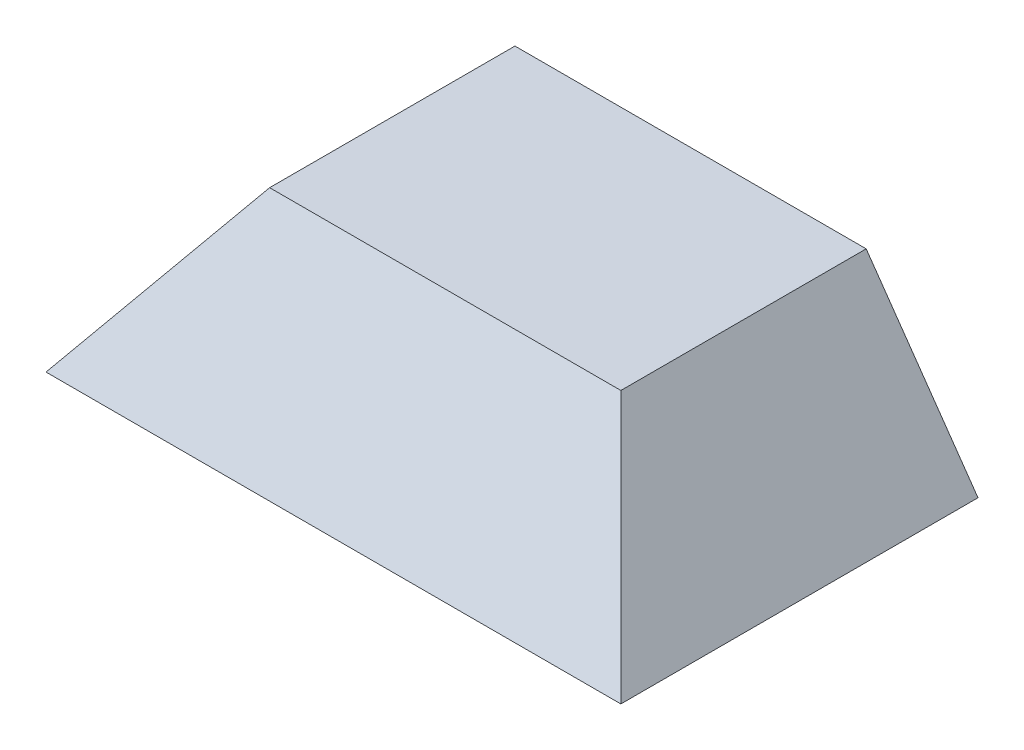
ISO-10303-21;
HEADER;
FILE_DESCRIPTION(('STEP AP214'),'2;1');
FILE_NAME('part.step','',(''),(''),'','','');
FILE_SCHEMA(('AUTOMOTIVE_DESIGN { 1 0 10303 214 1 1 1 1 }'));
ENDSEC;
DATA;
#1=APPLICATION_CONTEXT('core data for automotive mechanical design processes');
#2=APPLICATION_PROTOCOL_DEFINITION('international standard','automotive_design',2000,#1);
#3=PRODUCT_CONTEXT('',#1,'mechanical');
#4=PRODUCT('Part','Part','',(#3));
#5=PRODUCT_RELATED_PRODUCT_CATEGORY('part','',(#4));
#6=PRODUCT_DEFINITION_FORMATION('','',#4);
#7=PRODUCT_DEFINITION_CONTEXT('part definition',#1,'design');
#8=PRODUCT_DEFINITION('design','',#6,#7);
#9=PRODUCT_DEFINITION_SHAPE('','',#8);
#10=(LENGTH_UNIT() NAMED_UNIT(*) SI_UNIT(.MILLI.,.METRE.));
#11=(NAMED_UNIT(*) PLANE_ANGLE_UNIT() SI_UNIT($,.RADIAN.));
#12=(NAMED_UNIT(*) SI_UNIT($,.STERADIAN.) SOLID_ANGLE_UNIT());
#13=UNCERTAINTY_MEASURE_WITH_UNIT(LENGTH_MEASURE(1.E-05),#10,'distance_accuracy_value','');
#14=(GEOMETRIC_REPRESENTATION_CONTEXT(3) GLOBAL_UNCERTAINTY_ASSIGNED_CONTEXT((#13)) GLOBAL_UNIT_ASSIGNED_CONTEXT((#10,
#11,#12)) REPRESENTATION_CONTEXT('',''));
#15=CARTESIAN_POINT('',(0.,0.,0.));
#16=DIRECTION('',(0.,0.,1.));
#17=DIRECTION('',(1.,0.,0.));
#18=AXIS2_PLACEMENT_3D('',#15,#16,#17);
#19=CARTESIAN_POINT('',(-70.,0.,0.));
#20=DIRECTION('',(-1.,0.,0.));
#21=DIRECTION('',(0.,0.,-1.));
#22=AXIS2_PLACEMENT_3D('',#19,#20,#21);
#23=PLANE('',#22);
#24=DIRECTION('',(0.,0.,1.));
#25=VECTOR('',#24,1.);
#26=CARTESIAN_POINT('',(-70.,5.,-8.29628070749418));
#27=LINE('',#26,#25);
#28=CARTESIAN_POINT('',(-70.,5.,-8.29628070749418));
#29=VERTEX_POINT('',#28);
#30=CARTESIAN_POINT('',(-70.,5.,11.7037192925058));
#31=VERTEX_POINT('',#30);
#32=EDGE_CURVE('E242',#29,#31,#27,.T.);
#33=ORIENTED_EDGE('',*,*,#32,.T.);
#34=DIRECTION('',(0.,-1.,0.));
#35=VECTOR('',#34,1.);
#36=CARTESIAN_POINT('',(-70.,0.,11.7037192925058));
#37=LINE('',#36,#35);
#38=CARTESIAN_POINT('',(-70.,0.,11.7037192925058));
#39=VERTEX_POINT('',#38);
#40=EDGE_CURVE('E257',#31,#39,#37,.T.);
#41=ORIENTED_EDGE('',*,*,#40,.T.);
#42=DIRECTION('',(0.,0.,-1.));
#43=VECTOR('',#42,1.);
#44=CARTESIAN_POINT('',(-70.,0.,-8.29628070749418));
#45=LINE('',#44,#43);
#46=CARTESIAN_POINT('',(-70.,0.,-8.29628070749418));
#47=VERTEX_POINT('',#46);
#48=EDGE_CURVE('E261',#39,#47,#45,.T.);
#49=ORIENTED_EDGE('',*,*,#48,.T.);
#50=DIRECTION('',(0.,1.,0.));
#51=VECTOR('',#50,1.);
#52=CARTESIAN_POINT('',(-70.,0.,-8.29628070749418));
#53=LINE('',#52,#51);
#54=EDGE_CURVE('E258',#47,#29,#53,.T.);
#55=ORIENTED_EDGE('',*,*,#54,.T.);
#56=EDGE_LOOP('',(#33,#41,#49,#55));
#57=FACE_BOUND('',#56,.T.);
#58=ADVANCED_FACE('F45',(#57),#23,.F.);
#59=DIRECTION('',(0.,0.,-1.));
#60=VECTOR('',#59,1.);
#61=CARTESIAN_POINT('',(-70.,10.,-8.29628070749418));
#62=LINE('',#61,#60);
#63=CARTESIAN_POINT('',(-70.,10.,11.7037192925058));
#64=VERTEX_POINT('',#63);
#65=CARTESIAN_POINT('',(-70.,10.,-8.29628070749418));
#66=VERTEX_POINT('',#65);
#67=EDGE_CURVE('E586',#64,#66,#62,.T.);
#68=ORIENTED_EDGE('',*,*,#67,.T.);
#69=CARTESIAN_POINT('',(-70.,20.,-8.29628070749418));
#70=VERTEX_POINT('',#69);
#71=EDGE_CURVE('E247',#66,#70,#53,.T.);
#72=ORIENTED_EDGE('',*,*,#71,.T.);
#73=DIRECTION('',(0.,0.,1.));
#74=VECTOR('',#73,1.);
#75=CARTESIAN_POINT('',(-70.,20.,-8.29628070749418));
#76=LINE('',#75,#74);
#77=CARTESIAN_POINT('',(-70.,20.,11.7037192925058));
#78=VERTEX_POINT('',#77);
#79=EDGE_CURVE('E254',#70,#78,#76,.T.);
#80=ORIENTED_EDGE('',*,*,#79,.T.);
#81=EDGE_CURVE('E265',#78,#64,#37,.T.);
#82=ORIENTED_EDGE('',*,*,#81,.T.);
#83=EDGE_LOOP('',(#68,#72,#80,#82));
#84=FACE_BOUND('',#83,.T.);
#85=ADVANCED_FACE('F498',(#84),#23,.F.);
#86=CARTESIAN_POINT('',(-90.002,0.,11.7037192925058));
#87=DIRECTION('',(0.,0.,1.));
#88=DIRECTION('',(1.,0.,0.));
#89=AXIS2_PLACEMENT_3D('',#86,#87,#88);
#90=PLANE('',#89);
#91=ORIENTED_EDGE('',*,*,#40,.F.);
#92=DIRECTION('',(1.,0.,0.));
#93=VECTOR('',#92,1.);
#94=CARTESIAN_POINT('',(-78.,5.,11.7037192925058));
#95=LINE('',#94,#93);
#96=CARTESIAN_POINT('',(-78.,5.,11.7037192925058));
#97=VERTEX_POINT('',#96);
#98=EDGE_CURVE('E249',#97,#31,#95,.T.);
#99=ORIENTED_EDGE('',*,*,#98,.F.);
#100=DIRECTION('',(0.,1.,0.));
#101=VECTOR('',#100,1.);
#102=CARTESIAN_POINT('',(-78.,10.,11.7037192925058));
#103=LINE('',#102,#101);
#104=CARTESIAN_POINT('',(-78.,10.,11.7037192925058));
#105=VERTEX_POINT('',#104);
#106=EDGE_CURVE('E235',#97,#105,#103,.T.);
#107=ORIENTED_EDGE('',*,*,#106,.T.);
#108=DIRECTION('',(1.,0.,0.));
#109=VECTOR('',#108,1.);
#110=CARTESIAN_POINT('',(-78.,10.,11.7037192925058));
#111=LINE('',#110,#109);
#112=EDGE_CURVE('E231',#105,#64,#111,.T.);
#113=ORIENTED_EDGE('',*,*,#112,.T.);
#114=ORIENTED_EDGE('',*,*,#81,.F.);
#115=DIRECTION('',(1.,0.,0.));
#116=VECTOR('',#115,1.);
#117=CARTESIAN_POINT('',(-90.002,20.,11.7037192925058));
#118=LINE('',#117,#116);
#119=CARTESIAN_POINT('',(-71.1127508807601,20.,11.7037192925058));
#120=VERTEX_POINT('',#119);
#121=EDGE_CURVE('E269',#120,#78,#118,.T.);
#122=ORIENTED_EDGE('',*,*,#121,.F.);
#123=DIRECTION('',(-0.573576436351042,-0.819152044288995,0.));
#124=VECTOR('',#123,1.);
#125=CARTESIAN_POINT('',(-86.7240498027007,-2.29524543802496,11.7037192925058));
#126=LINE('',#125,#124);
#127=CARTESIAN_POINT('',(-85.1169016449542,0.,11.7037192925058));
#128=VERTEX_POINT('',#127);
#129=EDGE_CURVE('E276',#120,#128,#126,.T.);
#130=ORIENTED_EDGE('',*,*,#129,.T.);
#131=DIRECTION('',(1.,0.,0.));
#132=VECTOR('',#131,1.);
#133=CARTESIAN_POINT('',(-90.002,0.,11.7037192925058));
#134=LINE('',#133,#132);
#135=EDGE_CURVE('E68',#128,#39,#134,.T.);
#136=ORIENTED_EDGE('',*,*,#135,.T.);
#137=EDGE_LOOP('',(#91,#99,#107,#113,#114,#122,#130,#136));
#138=FACE_BOUND('',#137,.T.);
#139=ADVANCED_FACE('F504',(#138),#90,.T.);
#140=CARTESIAN_POINT('',(-90.002,0.,-8.29628070749418));
#141=DIRECTION('',(0.,0.,-1.));
#142=DIRECTION('',(-1.,0.,0.));
#143=AXIS2_PLACEMENT_3D('',#140,#141,#142);
#144=PLANE('',#143);
#145=DIRECTION('',(0.,-1.,0.));
#146=VECTOR('',#145,1.);
#147=CARTESIAN_POINT('',(-78.,10.,-8.29628070749418));
#148=LINE('',#147,#146);
#149=CARTESIAN_POINT('',(-78.,10.,-8.29628070749418));
#150=VERTEX_POINT('',#149);
#151=CARTESIAN_POINT('',(-78.,5.,-8.29628070749418));
#152=VERTEX_POINT('',#151);
#153=EDGE_CURVE('E236',#150,#152,#148,.T.);
#154=ORIENTED_EDGE('',*,*,#153,.T.);
#155=DIRECTION('',(1.,0.,0.));
#156=VECTOR('',#155,1.);
#157=CARTESIAN_POINT('',(-78.,5.,-8.29628070749418));
#158=LINE('',#157,#156);
#159=EDGE_CURVE('E60',#152,#29,#158,.T.);
#160=ORIENTED_EDGE('',*,*,#159,.T.);
#161=ORIENTED_EDGE('',*,*,#54,.F.);
#162=DIRECTION('',(1.,0.,0.));
#163=VECTOR('',#162,1.);
#164=CARTESIAN_POINT('',(-90.002,0.,-8.29628070749418));
#165=LINE('',#164,#163);
#166=CARTESIAN_POINT('',(-85.1169016449542,0.,-8.29628070749418));
#167=VERTEX_POINT('',#166);
#168=EDGE_CURVE('E272',#167,#47,#165,.T.);
#169=ORIENTED_EDGE('',*,*,#168,.F.);
#170=DIRECTION('',(0.573576436351042,0.819152044288995,0.));
#171=VECTOR('',#170,1.);
#172=CARTESIAN_POINT('',(-86.7240498027007,-2.29524543802496,-8.29628070749418));
#173=LINE('',#172,#171);
#174=CARTESIAN_POINT('',(-71.1127508807601,20.,-8.29628070749418));
#175=VERTEX_POINT('',#174);
#176=EDGE_CURVE('E278',#167,#175,#173,.T.);
#177=ORIENTED_EDGE('',*,*,#176,.T.);
#178=DIRECTION('',(1.,0.,0.));
#179=VECTOR('',#178,1.);
#180=CARTESIAN_POINT('',(-90.002,20.,-8.29628070749418));
#181=LINE('',#180,#179);
#182=EDGE_CURVE('E264',#175,#70,#181,.T.);
#183=ORIENTED_EDGE('',*,*,#182,.T.);
#184=ORIENTED_EDGE('',*,*,#71,.F.);
#185=DIRECTION('',(1.,0.,0.));
#186=VECTOR('',#185,1.);
#187=CARTESIAN_POINT('',(-78.,10.,-8.29628070749418));
#188=LINE('',#187,#186);
#189=EDGE_CURVE('E228',#150,#66,#188,.T.);
#190=ORIENTED_EDGE('',*,*,#189,.F.);
#191=EDGE_LOOP('',(#154,#160,#161,#169,#177,#183,#184,#190));
#192=FACE_BOUND('',#191,.T.);
#193=ADVANCED_FACE('F245',(#192),#144,.T.);
#194=CARTESIAN_POINT('',(70.,0.,0.));
#195=DIRECTION('',(1.,0.,0.));
#196=DIRECTION('',(0.,0.,-1.));
#197=AXIS2_PLACEMENT_3D('',#194,#195,#196);
#198=PLANE('',#197);
#199=DIRECTION('',(0.,1.,0.));
#200=VECTOR('',#199,1.);
#201=CARTESIAN_POINT('',(70.,0.,-8.29628070749418));
#202=LINE('',#201,#200);
#203=CARTESIAN_POINT('',(70.,10.,-8.29628070749418));
#204=VERTEX_POINT('',#203);
#205=CARTESIAN_POINT('',(70.,20.,-8.29628070749418));
#206=VERTEX_POINT('',#205);
#207=EDGE_CURVE('E304',#204,#206,#202,.T.);
#208=ORIENTED_EDGE('',*,*,#207,.F.);
#209=DIRECTION('',(0.,0.,-1.));
#210=VECTOR('',#209,1.);
#211=CARTESIAN_POINT('',(70.,10.,-8.29628070749418));
#212=LINE('',#211,#210);
#213=CARTESIAN_POINT('',(70.,10.,11.7037192925058));
#214=VERTEX_POINT('',#213);
#215=EDGE_CURVE('E291',#214,#204,#212,.T.);
#216=ORIENTED_EDGE('',*,*,#215,.F.);
#217=DIRECTION('',(0.,-1.,0.));
#218=VECTOR('',#217,1.);
#219=CARTESIAN_POINT('',(70.,0.,11.7037192925058));
#220=LINE('',#219,#218);
#221=CARTESIAN_POINT('',(70.,20.,11.7037192925058));
#222=VERTEX_POINT('',#221);
#223=EDGE_CURVE('E322',#222,#214,#220,.T.);
#224=ORIENTED_EDGE('',*,*,#223,.F.);
#225=DIRECTION('',(0.,0.,1.));
#226=VECTOR('',#225,1.);
#227=CARTESIAN_POINT('',(70.,20.,-8.29628070749418));
#228=LINE('',#227,#226);
#229=EDGE_CURVE('E311',#206,#222,#228,.T.);
#230=ORIENTED_EDGE('',*,*,#229,.F.);
#231=EDGE_LOOP('',(#208,#216,#224,#230));
#232=FACE_BOUND('',#231,.T.);
#233=ADVANCED_FACE('F486',(#232),#198,.F.);
#234=CARTESIAN_POINT('',(86.723391822844,-2.29430574540417,-64.666));
#235=DIRECTION('',(-0.819152044288995,-0.573576436351042,0.));
#236=DIRECTION('',(0.573576436351042,-0.819152044288995,0.));
#237=AXIS2_PLACEMENT_3D('',#234,#235,#236);
#238=PLANE('',#237);
#239=DIRECTION('',(0.573576436351042,-0.819152044288995,0.));
#240=VECTOR('',#239,1.);
#241=CARTESIAN_POINT('',(86.723391822844,-2.29430574540417,0.));
#242=LINE('',#241,#240);
#243=CARTESIAN_POINT('',(52.9073548873079,46.,0.));
#244=VERTEX_POINT('',#243);
#245=CARTESIAN_POINT('',(71.1127508807601,20.,0.));
#246=VERTEX_POINT('',#245);
#247=EDGE_CURVE('E379',#244,#246,#242,.T.);
#248=ORIENTED_EDGE('',*,*,#247,.T.);
#249=DIRECTION('',(0.,0.,-1.));
#250=VECTOR('',#249,1.);
#251=CARTESIAN_POINT('',(71.1127508807601,20.,-8.29628070749418));
#252=LINE('',#251,#250);
#253=CARTESIAN_POINT('',(71.1127508807601,20.,11.7037192925058));
#254=VERTEX_POINT('',#253);
#255=EDGE_CURVE('E337',#254,#246,#252,.T.);
#256=ORIENTED_EDGE('',*,*,#255,.F.);
#257=DIRECTION('',(-0.573576436351042,0.819152044288995,0.));
#258=VECTOR('',#257,1.);
#259=CARTESIAN_POINT('',(86.7240498027007,-2.29524543802498,11.7037192925058));
#260=LINE('',#259,#258);
#261=CARTESIAN_POINT('',(85.1169016449542,0.,11.7037192925058));
#262=VERTEX_POINT('',#261);
#263=EDGE_CURVE('E328',#262,#254,#260,.T.);
#264=ORIENTED_EDGE('',*,*,#263,.F.);
#265=DIRECTION('',(0.,0.,-1.));
#266=VECTOR('',#265,1.);
#267=CARTESIAN_POINT('',(85.1169016449542,0.,-64.666));
#268=LINE('',#267,#266);
#269=CARTESIAN_POINT('',(85.1169016449542,0.,59.7819016449542));
#270=VERTEX_POINT('',#269);
#271=EDGE_CURVE('E396',#270,#262,#268,.T.);
#272=ORIENTED_EDGE('',*,*,#271,.F.);
#273=DIRECTION('',(0.49754281216452,-0.710564775461634,0.49754281216452));
#274=VECTOR('',#273,1.);
#275=CARTESIAN_POINT('',(87.5347599576417,-3.45305952984959,62.1997599576417));
#276=LINE('',#275,#274);
#277=CARTESIAN_POINT('',(52.9073548873079,46.,27.5723548873079));
#278=VERTEX_POINT('',#277);
#279=EDGE_CURVE('E385',#278,#270,#276,.T.);
#280=ORIENTED_EDGE('',*,*,#279,.F.);
#281=DIRECTION('',(0.,0.,1.));
#282=VECTOR('',#281,1.);
#283=CARTESIAN_POINT('',(52.9073548873079,46.,0.));
#284=LINE('',#283,#282);
#285=EDGE_CURVE('E389',#244,#278,#284,.T.);
#286=ORIENTED_EDGE('',*,*,#285,.F.);
#287=EDGE_LOOP('',(#248,#256,#264,#272,#280,#286));
#288=FACE_BOUND('',#287,.T.);
#289=ADVANCED_FACE('F484',(#288),#238,.T.);
#290=CARTESIAN_POINT('',(0.,0.,0.));
#291=DIRECTION('',(0.,0.,1.));
#292=DIRECTION('',(1.,0.,0.));
#293=AXIS2_PLACEMENT_3D('',#290,#291,#292);
#294=PLANE('',#293);
#295=DIRECTION('',(-1.,0.,0.));
#296=VECTOR('',#295,1.);
#297=CARTESIAN_POINT('',(90.002,20.,0.));
#298=LINE('',#297,#296);
#299=CARTESIAN_POINT('',(71.1364284841101,20.,0.));
#300=VERTEX_POINT('',#299);
#301=EDGE_CURVE('E341',#300,#246,#298,.T.);
#302=ORIENTED_EDGE('',*,*,#301,.T.);
#303=ORIENTED_EDGE('',*,*,#247,.F.);
#304=DIRECTION('',(-1.,0.,0.));
#305=VECTOR('',#304,1.);
#306=CARTESIAN_POINT('',(0.,46.,0.));
#307=LINE('',#306,#305);
#308=CARTESIAN_POINT('',(-52.9073548873079,46.,0.));
#309=VERTEX_POINT('',#308);
#310=EDGE_CURVE('E373',#244,#309,#307,.T.);
#311=ORIENTED_EDGE('',*,*,#310,.T.);
#312=DIRECTION('',(-0.573576436351041,-0.819152044288995,0.));
#313=VECTOR('',#312,1.);
#314=CARTESIAN_POINT('',(-85.1169016449542,0.,0.));
#315=LINE('',#314,#313);
#316=CARTESIAN_POINT('',(-52.8799125800155,46.0391916764601,0.));
#317=VERTEX_POINT('',#316);
#318=EDGE_CURVE('E367',#317,#309,#315,.T.);
#319=ORIENTED_EDGE('',*,*,#318,.F.);
#320=DIRECTION('',(-1.,0.,0.));
#321=VECTOR('',#320,1.);
#322=CARTESIAN_POINT('',(-52.8799125800155,46.0391916764601,0.));
#323=LINE('',#322,#321);
#324=CARTESIAN_POINT('',(52.9344174659689,46.0391916764601,0.));
#325=VERTEX_POINT('',#324);
#326=EDGE_CURVE('E364',#325,#317,#323,.T.);
#327=ORIENTED_EDGE('',*,*,#326,.F.);
#328=DIRECTION('',(-0.572925162497542,0.819607685528366,0.));
#329=VECTOR('',#328,1.);
#330=CARTESIAN_POINT('',(52.9344174659689,46.0391916764601,0.));
#331=LINE('',#330,#329);
#332=EDGE_CURVE('E362',#300,#325,#331,.T.);
#333=ORIENTED_EDGE('',*,*,#332,.F.);
#334=EDGE_LOOP('',(#302,#303,#311,#319,#327,#333));
#335=FACE_BOUND('',#334,.T.);
#336=ADVANCED_FACE('F445',(#335),#294,.F.);
#337=CARTESIAN_POINT('',(52.9344174659689,46.0391916764601,-278.930786247867));
#338=DIRECTION('',(0.819607685528366,0.572925162497542,0.));
#339=DIRECTION('',(-0.572925162497542,0.819607685528366,0.));
#340=AXIS2_PLACEMENT_3D('',#337,#338,#339);
#341=PLANE('',#340);
#342=DIRECTION('',(0.,0.,1.));
#343=VECTOR('',#342,1.);
#344=CARTESIAN_POINT('',(71.1364284841101,20.,-8.29628070749418));
#345=LINE('',#344,#343);
#346=CARTESIAN_POINT('',(71.1364284841101,20.,-8.29628070749416));
#347=VERTEX_POINT('',#346);
#348=EDGE_CURVE('E344',#347,#300,#345,.T.);
#349=ORIENTED_EDGE('',*,*,#348,.T.);
#350=ORIENTED_EDGE('',*,*,#332,.T.);
#351=DIRECTION('',(0.,0.,1.));
#352=VECTOR('',#351,1.);
#353=CARTESIAN_POINT('',(52.9344174659689,46.0391916764601,-278.930786247867));
#354=LINE('',#353,#352);
#355=CARTESIAN_POINT('',(52.9344174659689,46.0391916764601,-47.1598115447574));
#356=VERTEX_POINT('',#355);
#357=EDGE_CURVE('E374',#356,#325,#354,.T.);
#358=ORIENTED_EDGE('',*,*,#357,.F.);
#359=DIRECTION('',(0.572925162497542,-0.819607685528366,0.));
#360=VECTOR('',#359,1.);
#361=CARTESIAN_POINT('',(52.9344174659689,46.0391916764601,-47.1598115447574));
#362=LINE('',#361,#360);
#363=CARTESIAN_POINT('',(85.1169016449541,0.,-47.1598115447574));
#364=VERTEX_POINT('',#363);
#365=EDGE_CURVE('E354',#356,#364,#362,.T.);
#366=ORIENTED_EDGE('',*,*,#365,.T.);
#367=DIRECTION('',(0.,0.,1.));
#368=VECTOR('',#367,1.);
#369=CARTESIAN_POINT('',(85.1169016449542,0.,-278.930786247867));
#370=LINE('',#369,#368);
#371=CARTESIAN_POINT('',(85.1169016449542,0.,-8.29628070749422));
#372=VERTEX_POINT('',#371);
#373=EDGE_CURVE('E370',#364,#372,#370,.T.);
#374=ORIENTED_EDGE('',*,*,#373,.T.);
#375=DIRECTION('',(-0.572925162497542,0.819607685528366,0.));
#376=VECTOR('',#375,1.);
#377=CARTESIAN_POINT('',(86.7204021656378,-2.29391452239925,-8.29628070749418));
#378=LINE('',#377,#376);
#379=EDGE_CURVE('E340',#372,#347,#378,.T.);
#380=ORIENTED_EDGE('',*,*,#379,.T.);
#381=EDGE_LOOP('',(#349,#350,#358,#366,#374,#380));
#382=FACE_BOUND('',#381,.T.);
#383=ADVANCED_FACE('F436',(#382),#341,.F.);
#384=CARTESIAN_POINT('',(0.,46.,0.));
#385=DIRECTION('',(0.,1.,0.));
#386=DIRECTION('',(0.,0.,1.));
#387=AXIS2_PLACEMENT_3D('',#384,#385,#386);
#388=PLANE('',#387);
#389=ORIENTED_EDGE('',*,*,#310,.F.);
#390=ORIENTED_EDGE('',*,*,#285,.T.);
#391=DIRECTION('',(-1.,0.,0.));
#392=VECTOR('',#391,1.);
#393=CARTESIAN_POINT('',(90.001,46.,27.5723548873079));
#394=LINE('',#393,#392);
#395=CARTESIAN_POINT('',(-52.9073548873079,46.,27.5723548873079));
#396=VERTEX_POINT('',#395);
#397=EDGE_CURVE('E386',#278,#396,#394,.T.);
#398=ORIENTED_EDGE('',*,*,#397,.T.);
#399=DIRECTION('',(0.,0.,1.));
#400=VECTOR('',#399,1.);
#401=CARTESIAN_POINT('',(-52.9073548873079,46.,0.));
#402=LINE('',#401,#400);
#403=EDGE_CURVE('E383',#309,#396,#402,.T.);
#404=ORIENTED_EDGE('',*,*,#403,.F.);
#405=EDGE_LOOP('',(#389,#390,#398,#404));
#406=FACE_BOUND('',#405,.T.);
#407=ADVANCED_FACE('F454',(#406),#388,.F.);
#408=CARTESIAN_POINT('',(-86.723391822844,-2.29430574540417,-64.666));
#409=DIRECTION('',(-0.819152044288995,0.573576436351042,0.));
#410=DIRECTION('',(-0.573576436351042,-0.819152044288995,0.));
#411=AXIS2_PLACEMENT_3D('',#408,#409,#410);
#412=PLANE('',#411);
#413=DIRECTION('',(0.,0.,1.));
#414=VECTOR('',#413,1.);
#415=CARTESIAN_POINT('',(-85.1169016449542,0.,0.));
#416=LINE('',#415,#414);
#417=CARTESIAN_POINT('',(-85.1169016449542,0.,59.7819016449542));
#418=VERTEX_POINT('',#417);
#419=EDGE_CURVE('E391',#128,#418,#416,.T.);
#420=ORIENTED_EDGE('',*,*,#419,.F.);
#421=ORIENTED_EDGE('',*,*,#129,.F.);
#422=DIRECTION('',(0.,0.,1.));
#423=VECTOR('',#422,1.);
#424=CARTESIAN_POINT('',(-71.1127508807601,20.,-8.29628070749418));
#425=LINE('',#424,#423);
#426=EDGE_CURVE('E274',#175,#120,#425,.T.);
#427=ORIENTED_EDGE('',*,*,#426,.F.);
#428=ORIENTED_EDGE('',*,*,#176,.F.);
#429=CARTESIAN_POINT('',(-85.1169016449542,0.,-47.1598115447574));
#430=VERTEX_POINT('',#429);
#431=EDGE_CURVE('E403',#430,#167,#416,.T.);
#432=ORIENTED_EDGE('',*,*,#431,.F.);
#433=DIRECTION('',(0.573576436351042,0.819152044288995,0.));
#434=VECTOR('',#433,1.);
#435=CARTESIAN_POINT('',(-86.723391822844,-2.29430574540417,-47.1598115447574));
#436=LINE('',#435,#434);
#437=CARTESIAN_POINT('',(-52.8799125800155,46.0391916764601,-47.1598115447574));
#438=VERTEX_POINT('',#437);
#439=EDGE_CURVE('E350',#430,#438,#436,.T.);
#440=ORIENTED_EDGE('',*,*,#439,.T.);
#441=DIRECTION('',(0.,0.,1.));
#442=VECTOR('',#441,1.);
#443=CARTESIAN_POINT('',(-52.8799125800155,46.0391916764601,-278.930786247867));
#444=LINE('',#443,#442);
#445=EDGE_CURVE('E371',#438,#317,#444,.T.);
#446=ORIENTED_EDGE('',*,*,#445,.T.);
#447=ORIENTED_EDGE('',*,*,#318,.T.);
#448=ORIENTED_EDGE('',*,*,#403,.T.);
#449=DIRECTION('',(0.49754281216452,0.710564775461634,-0.49754281216452));
#450=VECTOR('',#449,1.);
#451=CARTESIAN_POINT('',(-55.5187720976441,42.2705097162863,30.1837720976441));
#452=LINE('',#451,#450);
#453=EDGE_CURVE('E382',#418,#396,#452,.T.);
#454=ORIENTED_EDGE('',*,*,#453,.F.);
#455=EDGE_LOOP('',(#420,#421,#427,#428,#432,#440,#446,#447,#448,#454));
#456=FACE_BOUND('',#455,.T.);
#457=ADVANCED_FACE('F451',(#456),#412,.F.);
#458=CARTESIAN_POINT('',(0.,50.,0.));
#459=DIRECTION('',(0.,1.,0.));
#460=DIRECTION('',(0.,0.,1.));
#461=AXIS2_PLACEMENT_3D('',#458,#459,#460);
#462=PLANE('',#461);
#463=DIRECTION('',(1.,0.,0.));
#464=VECTOR('',#463,1.);
#465=CARTESIAN_POINT('',(-90.,50.,-47.1598115447574));
#466=LINE('',#465,#464);
#467=CARTESIAN_POINT('',(-54.9896230895149,50.,-47.1598115447574));
#468=VERTEX_POINT('',#467);
#469=CARTESIAN_POINT('',(54.9896230895148,50.,-47.1598115447574));
#470=VERTEX_POINT('',#469);
#471=EDGE_CURVE('E343',#468,#470,#466,.T.);
#472=ORIENTED_EDGE('',*,*,#471,.F.);
#473=DIRECTION('',(0.,0.,1.));
#474=VECTOR('',#473,1.);
#475=CARTESIAN_POINT('',(-54.9896230895149,50.,-64.666));
#476=LINE('',#475,#474);
#477=CARTESIAN_POINT('',(-54.9896230895149,50.,29.6546230895149));
#478=VERTEX_POINT('',#477);
#479=EDGE_CURVE('E408',#468,#478,#476,.T.);
#480=ORIENTED_EDGE('',*,*,#479,.T.);
#481=DIRECTION('',(-1.,0.,0.));
#482=VECTOR('',#481,1.);
#483=CARTESIAN_POINT('',(90.001,50.,29.6546230895149));
#484=LINE('',#483,#482);
#485=CARTESIAN_POINT('',(54.9896230895149,50.,29.6546230895149));
#486=VERTEX_POINT('',#485);
#487=EDGE_CURVE('E413',#486,#478,#484,.T.);
#488=ORIENTED_EDGE('',*,*,#487,.F.);
#489=DIRECTION('',(0.,0.,1.));
#490=VECTOR('',#489,1.);
#491=CARTESIAN_POINT('',(54.9896230895149,50.,-64.666));
#492=LINE('',#491,#490);
#493=EDGE_CURVE('E416',#470,#486,#492,.T.);
#494=ORIENTED_EDGE('',*,*,#493,.F.);
#495=EDGE_LOOP('',(#472,#480,#488,#494));
#496=FACE_BOUND('',#495,.T.);
#497=ADVANCED_FACE('F566',(#496),#462,.T.);
#498=CARTESIAN_POINT('',(90.001,0.,64.665));
#499=DIRECTION('',(0.,0.573576436351041,0.819152044288995));
#500=DIRECTION('',(0.,-0.819152044288995,0.573576436351041));
#501=AXIS2_PLACEMENT_3D('',#498,#499,#500);
#502=PLANE('',#501);
#503=ORIENTED_EDGE('',*,*,#487,.T.);
#504=DIRECTION('',(0.49754281216452,0.710564775461634,-0.49754281216452));
#505=VECTOR('',#504,1.);
#506=CARTESIAN_POINT('',(-57.9842596888523,45.7232157097392,32.6492596888523));
#507=LINE('',#506,#505);
#508=CARTESIAN_POINT('',(-90.,0.,64.665));
#509=VERTEX_POINT('',#508);
#510=EDGE_CURVE('E399',#509,#478,#507,.T.);
#511=ORIENTED_EDGE('',*,*,#510,.F.);
#512=DIRECTION('',(1.,0.,0.));
#513=VECTOR('',#512,1.);
#514=CARTESIAN_POINT('',(90.,0.,64.665));
#515=LINE('',#514,#513);
#516=CARTESIAN_POINT('',(90.,0.,64.665));
#517=VERTEX_POINT('',#516);
#518=EDGE_CURVE('E420',#509,#517,#515,.T.);
#519=ORIENTED_EDGE('',*,*,#518,.T.);
#520=DIRECTION('',(0.49754281216452,-0.710564775461634,0.49754281216452));
#521=VECTOR('',#520,1.);
#522=CARTESIAN_POINT('',(90.0002475488499,-0.000353536396628211,64.6652475488499));
#523=LINE('',#522,#521);
#524=EDGE_CURVE('E410',#486,#517,#523,.T.);
#525=ORIENTED_EDGE('',*,*,#524,.F.);
#526=EDGE_LOOP('',(#503,#511,#519,#525));
#527=FACE_BOUND('',#526,.T.);
#528=ADVANCED_FACE('F563',(#527),#502,.T.);
#529=CARTESIAN_POINT('',(90.,0.,-64.666));
#530=DIRECTION('',(-0.819152044288995,-0.573576436351042,0.));
#531=DIRECTION('',(0.573576436351042,-0.819152044288995,0.));
#532=AXIS2_PLACEMENT_3D('',#529,#530,#531);
#533=PLANE('',#532);
#534=DIRECTION('',(0.,0.,-1.));
#535=VECTOR('',#534,1.);
#536=CARTESIAN_POINT('',(90.,0.,64.665));
#537=LINE('',#536,#535);
#538=CARTESIAN_POINT('',(90.,0.,-47.1598115447574));
#539=VERTEX_POINT('',#538);
#540=EDGE_CURVE('E53',#517,#539,#537,.T.);
#541=ORIENTED_EDGE('',*,*,#540,.T.);
#542=DIRECTION('',(-0.573576436351042,0.819152044288995,0.));
#543=VECTOR('',#542,1.);
#544=CARTESIAN_POINT('',(90.,0.,-47.1598115447574));
#545=LINE('',#544,#543);
#546=EDGE_CURVE('E357',#539,#470,#545,.T.);
#547=ORIENTED_EDGE('',*,*,#546,.T.);
#548=ORIENTED_EDGE('',*,*,#493,.T.);
#549=ORIENTED_EDGE('',*,*,#524,.T.);
#550=EDGE_LOOP('',(#541,#547,#548,#549));
#551=FACE_BOUND('',#550,.T.);
#552=ADVANCED_FACE('F424',(#551),#533,.F.);
#553=CARTESIAN_POINT('',(0.,0.,0.));
#554=DIRECTION('',(0.,1.,0.));
#555=DIRECTION('',(0.,0.,1.));
#556=AXIS2_PLACEMENT_3D('',#553,#554,#555);
#557=PLANE('',#556);
#558=CARTESIAN_POINT('',(-74.,0.,1.70371929250581));
#559=DIRECTION('',(0.,1.,0.));
#560=DIRECTION('',(0.,0.,1.));
#561=AXIS2_PLACEMENT_3D('',#558,#559,#560);
#562=CIRCLE('',#561,1.585);
#563=CARTESIAN_POINT('',(-74.,0.,3.28871929250581));
#564=VERTEX_POINT('',#563);
#565=EDGE_CURVE('E593',#564,#564,#562,.T.);
#566=ORIENTED_EDGE('',*,*,#565,.T.);
#567=EDGE_LOOP('',(#566));
#568=FACE_BOUND('',#567,.T.);
#569=CARTESIAN_POINT('',(74.,0.,1.70371929250581));
#570=DIRECTION('',(0.,1.,0.));
#571=DIRECTION('',(0.,0.,1.));
#572=AXIS2_PLACEMENT_3D('',#569,#570,#571);
#573=CIRCLE('',#572,1.585);
#574=CARTESIAN_POINT('',(74.,0.,3.28871929250581));
#575=VERTEX_POINT('',#574);
#576=EDGE_CURVE('E283',#575,#575,#573,.F.);
#577=ORIENTED_EDGE('',*,*,#576,.F.);
#578=EDGE_LOOP('',(#577));
#579=FACE_BOUND('',#578,.T.);
#580=ORIENTED_EDGE('',*,*,#271,.T.);
#581=DIRECTION('',(-1.,0.,0.));
#582=VECTOR('',#581,1.);
#583=CARTESIAN_POINT('',(90.002,0.,11.7037192925058));
#584=LINE('',#583,#582);
#585=CARTESIAN_POINT('',(70.,0.,11.7037192925058));
#586=VERTEX_POINT('',#585);
#587=EDGE_CURVE('E331',#262,#586,#584,.T.);
#588=ORIENTED_EDGE('',*,*,#587,.T.);
#589=DIRECTION('',(0.,0.,-1.));
#590=VECTOR('',#589,1.);
#591=CARTESIAN_POINT('',(70.,0.,-8.29628070749418));
#592=LINE('',#591,#590);
#593=CARTESIAN_POINT('',(70.,0.,-8.29628070749418));
#594=VERTEX_POINT('',#593);
#595=EDGE_CURVE('E318',#586,#594,#592,.T.);
#596=ORIENTED_EDGE('',*,*,#595,.T.);
#597=DIRECTION('',(-1.,0.,0.));
#598=VECTOR('',#597,1.);
#599=CARTESIAN_POINT('',(90.002,0.,-8.29628070749418));
#600=LINE('',#599,#598);
#601=EDGE_CURVE('E321',#372,#594,#600,.T.);
#602=ORIENTED_EDGE('',*,*,#601,.F.);
#603=ORIENTED_EDGE('',*,*,#373,.F.);
#604=DIRECTION('',(1.,0.,0.));
#605=VECTOR('',#604,1.);
#606=CARTESIAN_POINT('',(-90.,0.,-47.1598115447574));
#607=LINE('',#606,#605);
#608=EDGE_CURVE('E351',#364,#539,#607,.T.);
#609=ORIENTED_EDGE('',*,*,#608,.T.);
#610=ORIENTED_EDGE('',*,*,#540,.F.);
#611=ORIENTED_EDGE('',*,*,#518,.F.);
#612=DIRECTION('',(0.,0.,1.));
#613=VECTOR('',#612,1.);
#614=CARTESIAN_POINT('',(-90.,0.,64.665));
#615=LINE('',#614,#613);
#616=CARTESIAN_POINT('',(-90.,0.,-47.1598115447574));
#617=VERTEX_POINT('',#616);
#618=EDGE_CURVE('E418',#617,#509,#615,.T.);
#619=ORIENTED_EDGE('',*,*,#618,.F.);
#620=EDGE_CURVE('E347',#617,#430,#607,.T.);
#621=ORIENTED_EDGE('',*,*,#620,.T.);
#622=ORIENTED_EDGE('',*,*,#431,.T.);
#623=ORIENTED_EDGE('',*,*,#168,.T.);
#624=ORIENTED_EDGE('',*,*,#48,.F.);
#625=ORIENTED_EDGE('',*,*,#135,.F.);
#626=ORIENTED_EDGE('',*,*,#419,.T.);
#627=DIRECTION('',(1.,0.,0.));
#628=VECTOR('',#627,1.);
#629=CARTESIAN_POINT('',(0.,0.,59.7819016449542));
#630=LINE('',#629,#628);
#631=EDGE_CURVE('E400',#418,#270,#630,.T.);
#632=ORIENTED_EDGE('',*,*,#631,.T.);
#633=EDGE_LOOP('',(#580,#588,#596,#602,#603,#609,#610,#611,#619,#621,#622,#623,#624,#625,#626,#632));
#634=FACE_BOUND('',#633,.T.);
#635=ADVANCED_FACE('F47',(#568,#579,#634),#557,.F.);
#636=CARTESIAN_POINT('',(-90.,0.,-64.666));
#637=DIRECTION('',(-0.819152044288995,0.573576436351042,0.));
#638=DIRECTION('',(-0.573576436351042,-0.819152044288995,0.));
#639=AXIS2_PLACEMENT_3D('',#636,#637,#638);
#640=PLANE('',#639);
#641=DIRECTION('',(0.573576436351042,0.819152044288995,0.));
#642=VECTOR('',#641,1.);
#643=CARTESIAN_POINT('',(-90.,0.,-47.1598115447574));
#644=LINE('',#643,#642);
#645=EDGE_CURVE('E359',#617,#468,#644,.T.);
#646=ORIENTED_EDGE('',*,*,#645,.F.);
#647=ORIENTED_EDGE('',*,*,#618,.T.);
#648=ORIENTED_EDGE('',*,*,#510,.T.);
#649=ORIENTED_EDGE('',*,*,#479,.F.);
#650=EDGE_LOOP('',(#646,#647,#648,#649));
#651=FACE_BOUND('',#650,.T.);
#652=ADVANCED_FACE('F551',(#651),#640,.T.);
#653=CARTESIAN_POINT('',(90.001,-2.29430574540417,61.388391822844));
#654=DIRECTION('',(0.,0.573576436351041,0.819152044288995));
#655=DIRECTION('',(0.,-0.819152044288995,0.573576436351041));
#656=AXIS2_PLACEMENT_3D('',#653,#654,#655);
#657=PLANE('',#656);
#658=ORIENTED_EDGE('',*,*,#397,.F.);
#659=ORIENTED_EDGE('',*,*,#279,.T.);
#660=ORIENTED_EDGE('',*,*,#631,.F.);
#661=ORIENTED_EDGE('',*,*,#453,.T.);
#662=EDGE_LOOP('',(#658,#659,#660,#661));
#663=FACE_BOUND('',#662,.T.);
#664=ADVANCED_FACE('F459',(#663),#657,.F.);
#665=CARTESIAN_POINT('',(-52.8799125800155,46.0391916764601,-278.930786247867));
#666=DIRECTION('',(0.,1.,0.));
#667=DIRECTION('',(0.,0.,1.));
#668=AXIS2_PLACEMENT_3D('',#665,#666,#667);
#669=PLANE('',#668);
#670=ORIENTED_EDGE('',*,*,#445,.F.);
#671=DIRECTION('',(1.,0.,0.));
#672=VECTOR('',#671,1.);
#673=CARTESIAN_POINT('',(-52.8799125800155,46.0391916764601,-47.1598115447574));
#674=LINE('',#673,#672);
#675=EDGE_CURVE('E12',#438,#356,#674,.T.);
#676=ORIENTED_EDGE('',*,*,#675,.T.);
#677=ORIENTED_EDGE('',*,*,#357,.T.);
#678=ORIENTED_EDGE('',*,*,#326,.T.);
#679=EDGE_LOOP('',(#670,#676,#677,#678));
#680=FACE_BOUND('',#679,.T.);
#681=ADVANCED_FACE('F442',(#680),#669,.F.);
#682=CARTESIAN_POINT('',(-90.,0.,-47.1598115447574));
#683=DIRECTION('',(0.,0.,1.));
#684=DIRECTION('',(1.,0.,0.));
#685=AXIS2_PLACEMENT_3D('',#682,#683,#684);
#686=PLANE('',#685);
#687=ORIENTED_EDGE('',*,*,#645,.T.);
#688=ORIENTED_EDGE('',*,*,#471,.T.);
#689=ORIENTED_EDGE('',*,*,#546,.F.);
#690=ORIENTED_EDGE('',*,*,#608,.F.);
#691=ORIENTED_EDGE('',*,*,#365,.F.);
#692=ORIENTED_EDGE('',*,*,#675,.F.);
#693=ORIENTED_EDGE('',*,*,#439,.F.);
#694=ORIENTED_EDGE('',*,*,#620,.F.);
#695=EDGE_LOOP('',(#687,#688,#689,#690,#691,#692,#693,#694));
#696=FACE_BOUND('',#695,.T.);
#697=ADVANCED_FACE('F432',(#696),#686,.F.);
#698=CARTESIAN_POINT('',(90.002,20.,-8.29628070749418));
#699=DIRECTION('',(0.,-1.,0.));
#700=DIRECTION('',(0.,0.,-1.));
#701=AXIS2_PLACEMENT_3D('',#698,#699,#700);
#702=PLANE('',#701);
#703=ORIENTED_EDGE('',*,*,#348,.F.);
#704=DIRECTION('',(-1.,0.,0.));
#705=VECTOR('',#704,1.);
#706=CARTESIAN_POINT('',(90.002,20.,-8.29628070749418));
#707=LINE('',#706,#705);
#708=EDGE_CURVE('E325',#347,#206,#707,.T.);
#709=ORIENTED_EDGE('',*,*,#708,.T.);
#710=ORIENTED_EDGE('',*,*,#229,.T.);
#711=DIRECTION('',(-1.,0.,0.));
#712=VECTOR('',#711,1.);
#713=CARTESIAN_POINT('',(90.002,20.,11.7037192925058));
#714=LINE('',#713,#712);
#715=EDGE_CURVE('E329',#254,#222,#714,.T.);
#716=ORIENTED_EDGE('',*,*,#715,.F.);
#717=ORIENTED_EDGE('',*,*,#255,.T.);
#718=ORIENTED_EDGE('',*,*,#301,.F.);
#719=EDGE_LOOP('',(#703,#709,#710,#716,#717,#718));
#720=FACE_BOUND('',#719,.T.);
#721=ADVANCED_FACE('F482',(#720),#702,.F.);
#722=CARTESIAN_POINT('',(70.,5.,11.7037192925058));
#723=VERTEX_POINT('',#722);
#724=EDGE_CURVE('E314',#723,#586,#220,.T.);
#725=ORIENTED_EDGE('',*,*,#724,.F.);
#726=DIRECTION('',(0.,0.,1.));
#727=VECTOR('',#726,1.);
#728=CARTESIAN_POINT('',(70.,5.,-8.29628070749418));
#729=LINE('',#728,#727);
#730=CARTESIAN_POINT('',(70.,5.,-8.29628070749418));
#731=VERTEX_POINT('',#730);
#732=EDGE_CURVE('E286',#731,#723,#729,.T.);
#733=ORIENTED_EDGE('',*,*,#732,.F.);
#734=EDGE_CURVE('E315',#594,#731,#202,.T.);
#735=ORIENTED_EDGE('',*,*,#734,.F.);
#736=ORIENTED_EDGE('',*,*,#595,.F.);
#737=EDGE_LOOP('',(#725,#733,#735,#736));
#738=FACE_BOUND('',#737,.T.);
#739=ADVANCED_FACE('F473',(#738),#198,.F.);
#740=CARTESIAN_POINT('',(90.002,0.,11.7037192925058));
#741=DIRECTION('',(0.,0.,-1.));
#742=DIRECTION('',(-1.,0.,0.));
#743=AXIS2_PLACEMENT_3D('',#740,#741,#742);
#744=PLANE('',#743);
#745=ORIENTED_EDGE('',*,*,#223,.T.);
#746=DIRECTION('',(-1.,0.,0.));
#747=VECTOR('',#746,1.);
#748=CARTESIAN_POINT('',(78.,10.,11.7037192925058));
#749=LINE('',#748,#747);
#750=CARTESIAN_POINT('',(78.,10.,11.7037192925058));
#751=VERTEX_POINT('',#750);
#752=EDGE_CURVE('E305',#751,#214,#749,.T.);
#753=ORIENTED_EDGE('',*,*,#752,.F.);
#754=DIRECTION('',(0.,1.,0.));
#755=VECTOR('',#754,1.);
#756=CARTESIAN_POINT('',(78.,10.,11.7037192925058));
#757=LINE('',#756,#755);
#758=CARTESIAN_POINT('',(78.,5.,11.7037192925058));
#759=VERTEX_POINT('',#758);
#760=EDGE_CURVE('E294',#759,#751,#757,.T.);
#761=ORIENTED_EDGE('',*,*,#760,.F.);
#762=DIRECTION('',(-1.,0.,0.));
#763=VECTOR('',#762,1.);
#764=CARTESIAN_POINT('',(78.,5.,11.7037192925058));
#765=LINE('',#764,#763);
#766=EDGE_CURVE('E307',#759,#723,#765,.T.);
#767=ORIENTED_EDGE('',*,*,#766,.T.);
#768=ORIENTED_EDGE('',*,*,#724,.T.);
#769=ORIENTED_EDGE('',*,*,#587,.F.);
#770=ORIENTED_EDGE('',*,*,#263,.T.);
#771=ORIENTED_EDGE('',*,*,#715,.T.);
#772=EDGE_LOOP('',(#745,#753,#761,#767,#768,#769,#770,#771));
#773=FACE_BOUND('',#772,.T.);
#774=ADVANCED_FACE('F467',(#773),#744,.F.);
#775=CARTESIAN_POINT('',(90.002,0.,-8.29628070749418));
#776=DIRECTION('',(0.,0.,1.));
#777=DIRECTION('',(1.,0.,0.));
#778=AXIS2_PLACEMENT_3D('',#775,#776,#777);
#779=PLANE('',#778);
#780=DIRECTION('',(0.,-1.,0.));
#781=VECTOR('',#780,1.);
#782=CARTESIAN_POINT('',(78.,10.,-8.29628070749418));
#783=LINE('',#782,#781);
#784=CARTESIAN_POINT('',(78.,10.,-8.29628070749418));
#785=VERTEX_POINT('',#784);
#786=CARTESIAN_POINT('',(78.,5.,-8.29628070749418));
#787=VERTEX_POINT('',#786);
#788=EDGE_CURVE('E287',#785,#787,#783,.T.);
#789=ORIENTED_EDGE('',*,*,#788,.F.);
#790=DIRECTION('',(-1.,0.,0.));
#791=VECTOR('',#790,1.);
#792=CARTESIAN_POINT('',(78.,10.,-8.29628070749418));
#793=LINE('',#792,#791);
#794=EDGE_CURVE('E301',#785,#204,#793,.T.);
#795=ORIENTED_EDGE('',*,*,#794,.T.);
#796=ORIENTED_EDGE('',*,*,#207,.T.);
#797=ORIENTED_EDGE('',*,*,#708,.F.);
#798=ORIENTED_EDGE('',*,*,#379,.F.);
#799=ORIENTED_EDGE('',*,*,#601,.T.);
#800=ORIENTED_EDGE('',*,*,#734,.T.);
#801=DIRECTION('',(-1.,0.,0.));
#802=VECTOR('',#801,1.);
#803=CARTESIAN_POINT('',(78.,5.,-8.29628070749418));
#804=LINE('',#803,#802);
#805=EDGE_CURVE('E298',#787,#731,#804,.T.);
#806=ORIENTED_EDGE('',*,*,#805,.F.);
#807=EDGE_LOOP('',(#789,#795,#796,#797,#798,#799,#800,#806));
#808=FACE_BOUND('',#807,.T.);
#809=ADVANCED_FACE('F477',(#808),#779,.F.);
#810=CARTESIAN_POINT('',(78.,10.,-8.29628070749418));
#811=DIRECTION('',(0.,1.,0.));
#812=DIRECTION('',(0.,0.,1.));
#813=AXIS2_PLACEMENT_3D('',#810,#811,#812);
#814=PLANE('',#813);
#815=ORIENTED_EDGE('',*,*,#215,.T.);
#816=ORIENTED_EDGE('',*,*,#794,.F.);
#817=DIRECTION('',(0.,0.,-1.));
#818=VECTOR('',#817,1.);
#819=CARTESIAN_POINT('',(78.,10.,-8.29628070749418));
#820=LINE('',#819,#818);
#821=EDGE_CURVE('E296',#751,#785,#820,.T.);
#822=ORIENTED_EDGE('',*,*,#821,.F.);
#823=ORIENTED_EDGE('',*,*,#752,.T.);
#824=EDGE_LOOP('',(#815,#816,#822,#823));
#825=FACE_BOUND('',#824,.T.);
#826=ADVANCED_FACE('F529',(#825),#814,.F.);
#827=CARTESIAN_POINT('',(78.,5.,-8.29628070749418));
#828=DIRECTION('',(0.,-1.,0.));
#829=DIRECTION('',(0.,0.,-1.));
#830=AXIS2_PLACEMENT_3D('',#827,#828,#829);
#831=PLANE('',#830);
#832=CARTESIAN_POINT('',(74.,5.,1.70371929250581));
#833=DIRECTION('',(0.,1.,0.));
#834=DIRECTION('',(0.,0.,1.));
#835=AXIS2_PLACEMENT_3D('',#832,#833,#834);
#836=CIRCLE('',#835,1.585);
#837=CARTESIAN_POINT('',(74.,5.,3.28871929250581));
#838=VERTEX_POINT('',#837);
#839=EDGE_CURVE('E280',#838,#838,#836,.T.);
#840=ORIENTED_EDGE('',*,*,#839,.F.);
#841=EDGE_LOOP('',(#840));
#842=FACE_BOUND('',#841,.T.);
#843=ORIENTED_EDGE('',*,*,#732,.T.);
#844=ORIENTED_EDGE('',*,*,#766,.F.);
#845=DIRECTION('',(0.,0.,1.));
#846=VECTOR('',#845,1.);
#847=CARTESIAN_POINT('',(78.,5.,-8.29628070749418));
#848=LINE('',#847,#846);
#849=EDGE_CURVE('E290',#787,#759,#848,.T.);
#850=ORIENTED_EDGE('',*,*,#849,.F.);
#851=ORIENTED_EDGE('',*,*,#805,.T.);
#852=EDGE_LOOP('',(#843,#844,#850,#851));
#853=FACE_BOUND('',#852,.T.);
#854=ADVANCED_FACE('F527',(#842,#853),#831,.F.);
#855=CARTESIAN_POINT('',(78.,0.,0.));
#856=DIRECTION('',(-1.,0.,0.));
#857=DIRECTION('',(0.,0.,1.));
#858=AXIS2_PLACEMENT_3D('',#855,#856,#857);
#859=PLANE('',#858);
#860=ORIENTED_EDGE('',*,*,#788,.T.);
#861=ORIENTED_EDGE('',*,*,#849,.T.);
#862=ORIENTED_EDGE('',*,*,#760,.T.);
#863=ORIENTED_EDGE('',*,*,#821,.T.);
#864=EDGE_LOOP('',(#860,#861,#862,#863));
#865=FACE_BOUND('',#864,.T.);
#866=ADVANCED_FACE('F523',(#865),#859,.T.);
#867=CARTESIAN_POINT('',(74.,-0.00100000000000707,1.70371929250581));
#868=DIRECTION('',(0.,1.,0.));
#869=DIRECTION('',(0.,0.,1.));
#870=AXIS2_PLACEMENT_3D('',#867,#868,#869);
#871=CYLINDRICAL_SURFACE('',#870,1.585);
#872=ORIENTED_EDGE('',*,*,#839,.T.);
#873=EDGE_LOOP('',(#872));
#874=FACE_BOUND('',#873,.T.);
#875=ORIENTED_EDGE('',*,*,#576,.T.);
#876=EDGE_LOOP('',(#875));
#877=FACE_BOUND('',#876,.T.);
#878=ADVANCED_FACE('F517',(#874,#877),#871,.F.);
#879=CARTESIAN_POINT('',(-90.002,20.,-8.29628070749418));
#880=DIRECTION('',(0.,1.,0.));
#881=DIRECTION('',(0.,0.,1.));
#882=AXIS2_PLACEMENT_3D('',#879,#880,#881);
#883=PLANE('',#882);
#884=ORIENTED_EDGE('',*,*,#182,.F.);
#885=ORIENTED_EDGE('',*,*,#426,.T.);
#886=ORIENTED_EDGE('',*,*,#121,.T.);
#887=ORIENTED_EDGE('',*,*,#79,.F.);
#888=EDGE_LOOP('',(#884,#885,#886,#887));
#889=FACE_BOUND('',#888,.T.);
#890=ADVANCED_FACE('F513',(#889),#883,.T.);
#891=CARTESIAN_POINT('',(-78.,5.,-8.29628070749418));
#892=DIRECTION('',(0.,1.,0.));
#893=DIRECTION('',(0.,0.,1.));
#894=AXIS2_PLACEMENT_3D('',#891,#892,#893);
#895=PLANE('',#894);
#896=CARTESIAN_POINT('',(-74.,5.,1.70371929250581));
#897=DIRECTION('',(0.,-1.,0.));
#898=DIRECTION('',(0.,0.,1.));
#899=AXIS2_PLACEMENT_3D('',#896,#897,#898);
#900=CIRCLE('',#899,1.585);
#901=CARTESIAN_POINT('',(-74.,5.,3.28871929250581));
#902=VERTEX_POINT('',#901);
#903=EDGE_CURVE('E590',#902,#902,#900,.T.);
#904=ORIENTED_EDGE('',*,*,#903,.T.);
#905=EDGE_LOOP('',(#904));
#906=FACE_BOUND('',#905,.T.);
#907=ORIENTED_EDGE('',*,*,#32,.F.);
#908=ORIENTED_EDGE('',*,*,#159,.F.);
#909=DIRECTION('',(0.,0.,1.));
#910=VECTOR('',#909,1.);
#911=CARTESIAN_POINT('',(-78.,5.,-8.29628070749418));
#912=LINE('',#911,#910);
#913=EDGE_CURVE('E240',#152,#97,#912,.T.);
#914=ORIENTED_EDGE('',*,*,#913,.T.);
#915=ORIENTED_EDGE('',*,*,#98,.T.);
#916=EDGE_LOOP('',(#907,#908,#914,#915));
#917=FACE_BOUND('',#916,.T.);
#918=ADVANCED_FACE('F516',(#906,#917),#895,.T.);
#919=CARTESIAN_POINT('',(-78.,10.,-8.29628070749418));
#920=DIRECTION('',(0.,-1.,0.));
#921=DIRECTION('',(0.,0.,-1.));
#922=AXIS2_PLACEMENT_3D('',#919,#920,#921);
#923=PLANE('',#922);
#924=ORIENTED_EDGE('',*,*,#67,.F.);
#925=ORIENTED_EDGE('',*,*,#112,.F.);
#926=DIRECTION('',(0.,0.,-1.));
#927=VECTOR('',#926,1.);
#928=CARTESIAN_POINT('',(-78.,10.,-8.29628070749418));
#929=LINE('',#928,#927);
#930=EDGE_CURVE('E224',#105,#150,#929,.T.);
#931=ORIENTED_EDGE('',*,*,#930,.T.);
#932=ORIENTED_EDGE('',*,*,#189,.T.);
#933=EDGE_LOOP('',(#924,#925,#931,#932));
#934=FACE_BOUND('',#933,.T.);
#935=ADVANCED_FACE('F226',(#934),#923,.T.);
#936=CARTESIAN_POINT('',(-78.,0.,0.));
#937=DIRECTION('',(1.,0.,0.));
#938=DIRECTION('',(0.,0.,1.));
#939=AXIS2_PLACEMENT_3D('',#936,#937,#938);
#940=PLANE('',#939);
#941=ORIENTED_EDGE('',*,*,#153,.F.);
#942=ORIENTED_EDGE('',*,*,#930,.F.);
#943=ORIENTED_EDGE('',*,*,#106,.F.);
#944=ORIENTED_EDGE('',*,*,#913,.F.);
#945=EDGE_LOOP('',(#941,#942,#943,#944));
#946=FACE_BOUND('',#945,.T.);
#947=ADVANCED_FACE('F239',(#946),#940,.T.);
#948=CARTESIAN_POINT('',(-74.,-0.00100000000000707,1.70371929250581));
#949=DIRECTION('',(0.,1.,0.));
#950=DIRECTION('',(0.,0.,1.));
#951=AXIS2_PLACEMENT_3D('',#948,#949,#950);
#952=CYLINDRICAL_SURFACE('',#951,1.585);
#953=ORIENTED_EDGE('',*,*,#903,.F.);
#954=EDGE_LOOP('',(#953));
#955=FACE_BOUND('',#954,.T.);
#956=ORIENTED_EDGE('',*,*,#565,.F.);
#957=EDGE_LOOP('',(#956));
#958=FACE_BOUND('',#957,.T.);
#959=ADVANCED_FACE('F600',(#955,#958),#952,.F.);
#960=CLOSED_SHELL('',(#58,#85,#139,#193,#233,#289,#336,#383,#407,#457,#497,#528,#552,#635,#652,
#664,#681,#697,#721,#739,#774,#809,#826,#854,#866,#878,#890,#918,#935,#947,#959));
#961=MANIFOLD_SOLID_BREP('B2',#960);
#962=ADVANCED_BREP_SHAPE_REPRESENTATION('',(#18,#961),#14);
#963=SHAPE_DEFINITION_REPRESENTATION(#9,#962);
ENDSEC;
END-ISO-10303-21;
